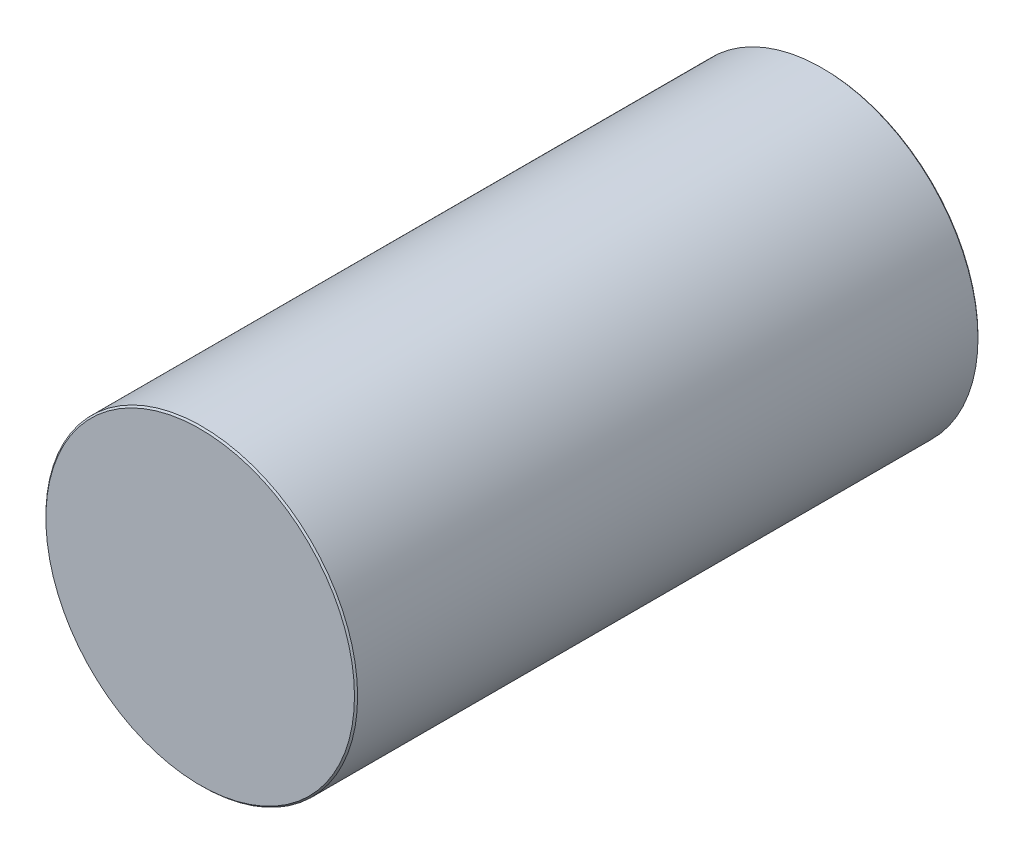
ISO-10303-21;
HEADER;
FILE_DESCRIPTION(('STEP AP214'),'2;1');
FILE_NAME('part.step','',(''),(''),'','','');
FILE_SCHEMA(('AUTOMOTIVE_DESIGN { 1 0 10303 214 1 1 1 1 }'));
ENDSEC;
DATA;
#1=APPLICATION_CONTEXT('core data for automotive mechanical design processes');
#2=APPLICATION_PROTOCOL_DEFINITION('international standard','automotive_design',2000,#1);
#3=PRODUCT_CONTEXT('',#1,'mechanical');
#4=PRODUCT('Part','Part','',(#3));
#5=PRODUCT_RELATED_PRODUCT_CATEGORY('part','',(#4));
#6=PRODUCT_DEFINITION_FORMATION('','',#4);
#7=PRODUCT_DEFINITION_CONTEXT('part definition',#1,'design');
#8=PRODUCT_DEFINITION('design','',#6,#7);
#9=PRODUCT_DEFINITION_SHAPE('','',#8);
#10=(LENGTH_UNIT() NAMED_UNIT(*) SI_UNIT(.MILLI.,.METRE.));
#11=(NAMED_UNIT(*) PLANE_ANGLE_UNIT() SI_UNIT($,.RADIAN.));
#12=(NAMED_UNIT(*) SI_UNIT($,.STERADIAN.) SOLID_ANGLE_UNIT());
#13=UNCERTAINTY_MEASURE_WITH_UNIT(LENGTH_MEASURE(1.E-05),#10,'distance_accuracy_value','');
#14=(GEOMETRIC_REPRESENTATION_CONTEXT(3) GLOBAL_UNCERTAINTY_ASSIGNED_CONTEXT((#13)) GLOBAL_UNIT_ASSIGNED_CONTEXT((#10,
#11,#12)) REPRESENTATION_CONTEXT('',''));
#15=CARTESIAN_POINT('',(0.,0.,0.));
#16=DIRECTION('',(0.,0.,1.));
#17=DIRECTION('',(1.,0.,0.));
#18=AXIS2_PLACEMENT_3D('',#15,#16,#17);
#19=CARTESIAN_POINT('',(0.,0.,400.));
#20=DIRECTION('',(0.,0.,-1.));
#21=DIRECTION('',(-1.,0.,0.));
#22=AXIS2_PLACEMENT_3D('',#19,#20,#21);
#23=CYLINDRICAL_SURFACE('',#22,100.);
#24=CARTESIAN_POINT('',(0.,0.,1.));
#25=DIRECTION('',(0.,0.,1.));
#26=DIRECTION('',(1.,0.,0.));
#27=AXIS2_PLACEMENT_3D('',#24,#25,#26);
#28=CIRCLE('',#27,100.);
#29=CARTESIAN_POINT('',(100.,0.,1.));
#30=VERTEX_POINT('',#29);
#31=EDGE_CURVE('E52',#30,#30,#28,.T.);
#32=ORIENTED_EDGE('',*,*,#31,.T.);
#33=EDGE_LOOP('',(#32));
#34=FACE_BOUND('',#33,.T.);
#35=CARTESIAN_POINT('',(0.,0.,399.));
#36=DIRECTION('',(0.,0.,1.));
#37=DIRECTION('',(1.,0.,0.));
#38=AXIS2_PLACEMENT_3D('',#35,#36,#37);
#39=CIRCLE('',#38,100.);
#40=CARTESIAN_POINT('',(100.,0.,399.));
#41=VERTEX_POINT('',#40);
#42=EDGE_CURVE('E57',#41,#41,#39,.F.);
#43=ORIENTED_EDGE('',*,*,#42,.T.);
#44=EDGE_LOOP('',(#43));
#45=FACE_BOUND('',#44,.T.);
#46=ADVANCED_FACE('F39',(#34,#45),#23,.T.);
#47=CARTESIAN_POINT('',(0.,0.,400.));
#48=DIRECTION('',(0.,0.,1.));
#49=DIRECTION('',(1.,0.,0.));
#50=AXIS2_PLACEMENT_3D('',#47,#48,#49);
#51=PLANE('',#50);
#52=CARTESIAN_POINT('',(0.,0.,400.));
#53=DIRECTION('',(0.,0.,1.));
#54=DIRECTION('',(1.,0.,0.));
#55=AXIS2_PLACEMENT_3D('',#52,#53,#54);
#56=CIRCLE('',#55,99.);
#57=CARTESIAN_POINT('',(99.,0.,400.));
#58=VERTEX_POINT('',#57);
#59=EDGE_CURVE('E10',#58,#58,#56,.T.);
#60=ORIENTED_EDGE('',*,*,#59,.T.);
#61=EDGE_LOOP('',(#60));
#62=FACE_BOUND('',#61,.T.);
#63=ADVANCED_FACE('F74',(#62),#51,.T.);
#64=CARTESIAN_POINT('',(0.,0.,0.));
#65=DIRECTION('',(0.,0.,1.));
#66=DIRECTION('',(1.,0.,0.));
#67=AXIS2_PLACEMENT_3D('',#64,#65,#66);
#68=PLANE('',#67);
#69=CARTESIAN_POINT('',(0.,0.,0.));
#70=DIRECTION('',(0.,0.,1.));
#71=DIRECTION('',(1.,0.,0.));
#72=AXIS2_PLACEMENT_3D('',#69,#70,#71);
#73=CIRCLE('',#72,99.);
#74=CARTESIAN_POINT('',(99.,0.,0.));
#75=VERTEX_POINT('',#74);
#76=EDGE_CURVE('E47',#75,#75,#73,.F.);
#77=ORIENTED_EDGE('',*,*,#76,.T.);
#78=EDGE_LOOP('',(#77));
#79=FACE_BOUND('',#78,.T.);
#80=ADVANCED_FACE('F71',(#79),#68,.F.);
#81=CARTESIAN_POINT('',(0.,0.,1.));
#82=DIRECTION('',(0.,0.,1.));
#83=DIRECTION('',(1.,0.,0.));
#84=AXIS2_PLACEMENT_3D('',#81,#82,#83);
#85=CONICAL_SURFACE('',#84,100.,0.785398163397448);
#86=ORIENTED_EDGE('',*,*,#76,.F.);
#87=EDGE_LOOP('',(#86));
#88=FACE_BOUND('',#87,.T.);
#89=ORIENTED_EDGE('',*,*,#31,.F.);
#90=EDGE_LOOP('',(#89));
#91=FACE_BOUND('',#90,.T.);
#92=ADVANCED_FACE('F67',(#88,#91),#85,.T.);
#93=CARTESIAN_POINT('',(0.,0.,400.));
#94=DIRECTION('',(0.,0.,-1.));
#95=DIRECTION('',(-1.,0.,0.));
#96=AXIS2_PLACEMENT_3D('',#93,#94,#95);
#97=CONICAL_SURFACE('',#96,99.,0.78539816339749);
#98=ORIENTED_EDGE('',*,*,#42,.F.);
#99=EDGE_LOOP('',(#98));
#100=FACE_BOUND('',#99,.T.);
#101=ORIENTED_EDGE('',*,*,#59,.F.);
#102=EDGE_LOOP('',(#101));
#103=FACE_BOUND('',#102,.T.);
#104=ADVANCED_FACE('F41',(#100,#103),#97,.T.);
#105=CLOSED_SHELL('',(#46,#63,#80,#92,#104));
#106=MANIFOLD_SOLID_BREP('B2',#105);
#107=ADVANCED_BREP_SHAPE_REPRESENTATION('',(#18,#106),#14);
#108=SHAPE_DEFINITION_REPRESENTATION(#9,#107);
ENDSEC;
END-ISO-10303-21;
